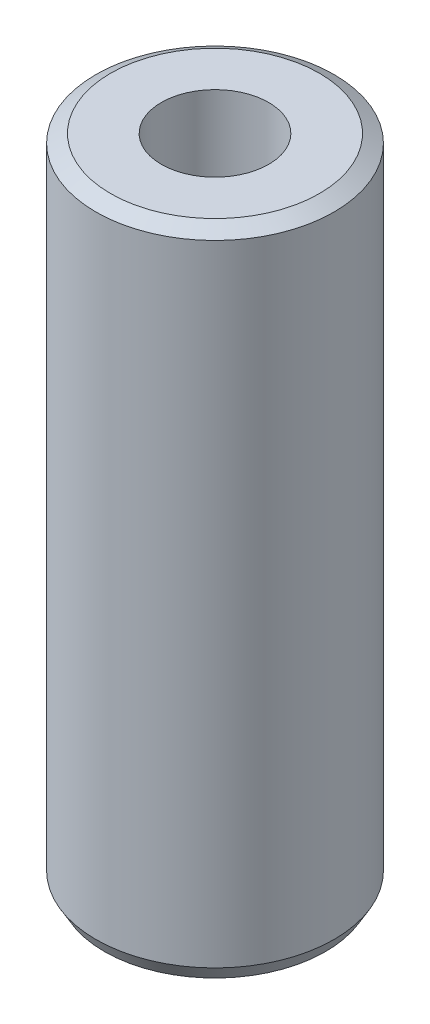
ISO-10303-21;
HEADER;
FILE_DESCRIPTION(('STEP AP214'),'2;1');
FILE_NAME('part.step','',(''),(''),'','','');
FILE_SCHEMA(('AUTOMOTIVE_DESIGN { 1 0 10303 214 1 1 1 1 }'));
ENDSEC;
DATA;
#1=APPLICATION_CONTEXT('core data for automotive mechanical design processes');
#2=APPLICATION_PROTOCOL_DEFINITION('international standard','automotive_design',2000,#1);
#3=PRODUCT_CONTEXT('',#1,'mechanical');
#4=PRODUCT('Part','Part','',(#3));
#5=PRODUCT_RELATED_PRODUCT_CATEGORY('part','',(#4));
#6=PRODUCT_DEFINITION_FORMATION('','',#4);
#7=PRODUCT_DEFINITION_CONTEXT('part definition',#1,'design');
#8=PRODUCT_DEFINITION('design','',#6,#7);
#9=PRODUCT_DEFINITION_SHAPE('','',#8);
#10=(LENGTH_UNIT() NAMED_UNIT(*) SI_UNIT(.MILLI.,.METRE.));
#11=(NAMED_UNIT(*) PLANE_ANGLE_UNIT() SI_UNIT($,.RADIAN.));
#12=(NAMED_UNIT(*) SI_UNIT($,.STERADIAN.) SOLID_ANGLE_UNIT());
#13=UNCERTAINTY_MEASURE_WITH_UNIT(LENGTH_MEASURE(1.E-05),#10,'distance_accuracy_value','');
#14=(GEOMETRIC_REPRESENTATION_CONTEXT(3) GLOBAL_UNCERTAINTY_ASSIGNED_CONTEXT((#13)) GLOBAL_UNIT_ASSIGNED_CONTEXT((#10,
#11,#12)) REPRESENTATION_CONTEXT('',''));
#15=CARTESIAN_POINT('',(0.,0.,0.));
#16=DIRECTION('',(0.,0.,1.));
#17=DIRECTION('',(1.,0.,0.));
#18=AXIS2_PLACEMENT_3D('',#15,#16,#17);
#19=CARTESIAN_POINT('',(0.,260.542871571112,0.));
#20=DIRECTION('',(0.,-1.,0.));
#21=DIRECTION('',(0.,0.,-1.));
#22=AXIS2_PLACEMENT_3D('',#19,#20,#21);
#23=CYLINDRICAL_SURFACE('',#22,47.5);
#24=CARTESIAN_POINT('',(0.,257.142513633217,0.));
#25=DIRECTION('',(0.,1.,0.));
#26=DIRECTION('',(0.,0.,1.));
#27=AXIS2_PLACEMENT_3D('',#24,#25,#26);
#28=CIRCLE('',#27,47.5);
#29=CARTESIAN_POINT('',(0.,257.142513633217,47.5));
#30=VERTEX_POINT('',#29);
#31=EDGE_CURVE('E50',#30,#30,#28,.F.);
#32=ORIENTED_EDGE('',*,*,#31,.T.);
#33=EDGE_LOOP('',(#32));
#34=FACE_BOUND('',#33,.T.);
#35=CARTESIAN_POINT('',(0.,5.88959271235462,0.));
#36=DIRECTION('',(0.,1.,0.));
#37=DIRECTION('',(0.,0.,1.));
#38=AXIS2_PLACEMENT_3D('',#35,#36,#37);
#39=CIRCLE('',#38,47.5);
#40=CARTESIAN_POINT('',(0.,5.88959271235462,47.5));
#41=VERTEX_POINT('',#40);
#42=EDGE_CURVE('E51',#41,#41,#39,.T.);
#43=ORIENTED_EDGE('',*,*,#42,.T.);
#44=EDGE_LOOP('',(#43));
#45=FACE_BOUND('',#44,.T.);
#46=ADVANCED_FACE('F39',(#34,#45),#23,.T.);
#47=CARTESIAN_POINT('',(0.,260.542871571112,0.));
#48=DIRECTION('',(0.,1.,0.));
#49=DIRECTION('',(0.,0.,1.));
#50=AXIS2_PLACEMENT_3D('',#47,#48,#49);
#51=PLANE('',#50);
#52=CARTESIAN_POINT('',(0.,260.542871571112,0.));
#53=DIRECTION('',(0.,1.,0.));
#54=DIRECTION('',(0.,0.,1.));
#55=AXIS2_PLACEMENT_3D('',#52,#53,#54);
#56=CIRCLE('',#55,41.6104072876454);
#57=CARTESIAN_POINT('',(0.,260.542871571112,41.6104072876454));
#58=VERTEX_POINT('',#57);
#59=EDGE_CURVE('E54',#58,#58,#56,.T.);
#60=ORIENTED_EDGE('',*,*,#59,.T.);
#61=EDGE_LOOP('',(#60));
#62=FACE_BOUND('',#61,.T.);
#63=CARTESIAN_POINT('',(0.,260.542871571112,0.));
#64=DIRECTION('',(0.,1.,0.));
#65=DIRECTION('',(0.,0.,1.));
#66=AXIS2_PLACEMENT_3D('',#63,#64,#65);
#67=CIRCLE('',#66,21.4012305634838);
#68=CARTESIAN_POINT('',(0.,260.542871571112,21.4012305634838));
#69=VERTEX_POINT('',#68);
#70=EDGE_CURVE('E58',#69,#69,#67,.T.);
#71=ORIENTED_EDGE('',*,*,#70,.F.);
#72=EDGE_LOOP('',(#71));
#73=FACE_BOUND('',#72,.T.);
#74=ADVANCED_FACE('F69',(#62,#73),#51,.T.);
#75=CARTESIAN_POINT('',(0.,0.,0.));
#76=DIRECTION('',(0.,1.,0.));
#77=DIRECTION('',(0.,0.,1.));
#78=AXIS2_PLACEMENT_3D('',#75,#76,#77);
#79=PLANE('',#78);
#80=CARTESIAN_POINT('',(0.,0.,0.));
#81=DIRECTION('',(0.,1.,0.));
#82=DIRECTION('',(0.,0.,1.));
#83=AXIS2_PLACEMENT_3D('',#80,#81,#82);
#84=CIRCLE('',#83,44.0996420621048);
#85=CARTESIAN_POINT('',(0.,0.,44.0996420621048));
#86=VERTEX_POINT('',#85);
#87=EDGE_CURVE('E10',#86,#86,#84,.F.);
#88=ORIENTED_EDGE('',*,*,#87,.T.);
#89=EDGE_LOOP('',(#88));
#90=FACE_BOUND('',#89,.T.);
#91=CARTESIAN_POINT('',(0.,0.,0.));
#92=DIRECTION('',(0.,1.,0.));
#93=DIRECTION('',(0.,0.,1.));
#94=AXIS2_PLACEMENT_3D('',#91,#92,#93);
#95=CIRCLE('',#94,21.4012305634838);
#96=CARTESIAN_POINT('',(0.,0.,21.4012305634838));
#97=VERTEX_POINT('',#96);
#98=EDGE_CURVE('E63',#97,#97,#95,.T.);
#99=ORIENTED_EDGE('',*,*,#98,.T.);
#100=EDGE_LOOP('',(#99));
#101=FACE_BOUND('',#100,.T.);
#102=ADVANCED_FACE('F75',(#90,#101),#79,.F.);
#103=CARTESIAN_POINT('',(0.,260.542871571112,0.));
#104=DIRECTION('',(0.,-1.,0.));
#105=DIRECTION('',(0.,0.,-1.));
#106=AXIS2_PLACEMENT_3D('',#103,#104,#105);
#107=CYLINDRICAL_SURFACE('',#106,21.4012305634838);
#108=ORIENTED_EDGE('',*,*,#70,.T.);
#109=EDGE_LOOP('',(#108));
#110=FACE_BOUND('',#109,.T.);
#111=ORIENTED_EDGE('',*,*,#98,.F.);
#112=EDGE_LOOP('',(#111));
#113=FACE_BOUND('',#112,.T.);
#114=ADVANCED_FACE('F70',(#110,#113),#107,.F.);
#115=CARTESIAN_POINT('',(0.,260.542871571112,0.));
#116=DIRECTION('',(0.,-1.,0.));
#117=DIRECTION('',(0.,0.,-1.));
#118=AXIS2_PLACEMENT_3D('',#115,#116,#117);
#119=CONICAL_SURFACE('',#118,41.6104072876454,1.0471975511966);
#120=ORIENTED_EDGE('',*,*,#31,.F.);
#121=EDGE_LOOP('',(#120));
#122=FACE_BOUND('',#121,.T.);
#123=ORIENTED_EDGE('',*,*,#59,.F.);
#124=EDGE_LOOP('',(#123));
#125=FACE_BOUND('',#124,.T.);
#126=ADVANCED_FACE('F81',(#122,#125),#119,.T.);
#127=CARTESIAN_POINT('',(0.,5.88959271235462,0.));
#128=DIRECTION('',(0.,1.,0.));
#129=DIRECTION('',(0.,0.,1.));
#130=AXIS2_PLACEMENT_3D('',#127,#128,#129);
#131=CONICAL_SURFACE('',#130,47.5,0.523598775598302);
#132=ORIENTED_EDGE('',*,*,#87,.F.);
#133=EDGE_LOOP('',(#132));
#134=FACE_BOUND('',#133,.T.);
#135=ORIENTED_EDGE('',*,*,#42,.F.);
#136=EDGE_LOOP('',(#135));
#137=FACE_BOUND('',#136,.T.);
#138=ADVANCED_FACE('F45',(#134,#137),#131,.T.);
#139=CLOSED_SHELL('',(#46,#74,#102,#114,#126,#138));
#140=MANIFOLD_SOLID_BREP('B2',#139);
#141=ADVANCED_BREP_SHAPE_REPRESENTATION('',(#18,#140),#14);
#142=SHAPE_DEFINITION_REPRESENTATION(#9,#141);
ENDSEC;
END-ISO-10303-21;
